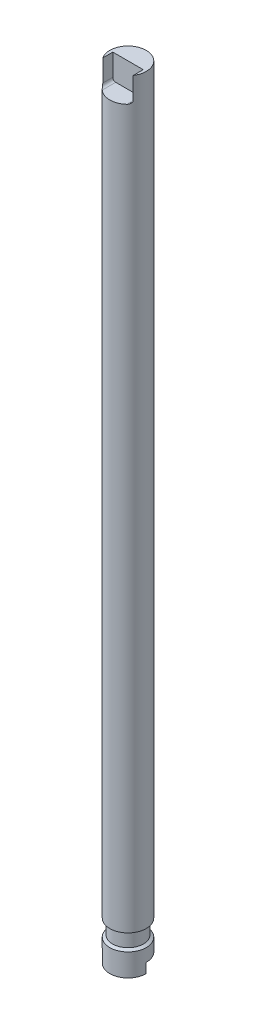
ISO-10303-21;
HEADER;
FILE_DESCRIPTION(('STEP AP214'),'2;1');
FILE_NAME('part.step','',(''),(''),'','','');
FILE_SCHEMA(('AUTOMOTIVE_DESIGN { 1 0 10303 214 1 1 1 1 }'));
ENDSEC;
DATA;
#1=APPLICATION_CONTEXT('core data for automotive mechanical design processes');
#2=APPLICATION_PROTOCOL_DEFINITION('international standard','automotive_design',2000,#1);
#3=PRODUCT_CONTEXT('',#1,'mechanical');
#4=PRODUCT('Part','Part','',(#3));
#5=PRODUCT_RELATED_PRODUCT_CATEGORY('part','',(#4));
#6=PRODUCT_DEFINITION_FORMATION('','',#4);
#7=PRODUCT_DEFINITION_CONTEXT('part definition',#1,'design');
#8=PRODUCT_DEFINITION('design','',#6,#7);
#9=PRODUCT_DEFINITION_SHAPE('','',#8);
#10=(LENGTH_UNIT() NAMED_UNIT(*) SI_UNIT(.MILLI.,.METRE.));
#11=(NAMED_UNIT(*) PLANE_ANGLE_UNIT() SI_UNIT($,.RADIAN.));
#12=(NAMED_UNIT(*) SI_UNIT($,.STERADIAN.) SOLID_ANGLE_UNIT());
#13=UNCERTAINTY_MEASURE_WITH_UNIT(LENGTH_MEASURE(1.E-05),#10,'distance_accuracy_value','');
#14=(GEOMETRIC_REPRESENTATION_CONTEXT(3) GLOBAL_UNCERTAINTY_ASSIGNED_CONTEXT((#13)) GLOBAL_UNIT_ASSIGNED_CONTEXT((#10,
#11,#12)) REPRESENTATION_CONTEXT('',''));
#15=CARTESIAN_POINT('',(0.,0.,0.));
#16=DIRECTION('',(0.,0.,1.));
#17=DIRECTION('',(1.,0.,0.));
#18=AXIS2_PLACEMENT_3D('',#15,#16,#17);
#19=CARTESIAN_POINT('',(-6.42480725316302E-06,661.678554121148,0.0981200194328381));
#20=DIRECTION('',(0.,-1.,0.));
#21=DIRECTION('',(0.,0.,-1.));
#22=AXIS2_PLACEMENT_3D('',#19,#20,#21);
#23=CYLINDRICAL_SURFACE('',#22,28.);
#24=DIRECTION('',(0.,1.,0.));
#25=VECTOR('',#24,1.);
#26=CARTESIAN_POINT('',(27.9999935751927,-538.321445878852,0.0981200194328381));
#27=LINE('',#26,#25);
#28=CARTESIAN_POINT('',(27.9999935751927,-538.321445878852,0.0981200194328381));
#29=VERTEX_POINT('',#28);
#30=CARTESIAN_POINT('',(27.9999935751927,-523.321445878852,0.0981200194328381));
#31=VERTEX_POINT('',#30);
#32=EDGE_CURVE('E60',#29,#31,#27,.T.);
#33=ORIENTED_EDGE('',*,*,#32,.T.);
#34=CARTESIAN_POINT('',(-6.42480725316302E-06,-523.321445878852,0.0981200194328381));
#35=DIRECTION('',(0.,1.,0.));
#36=DIRECTION('',(0.,0.,1.));
#37=AXIS2_PLACEMENT_3D('',#34,#35,#36);
#38=CIRCLE('',#37,28.);
#39=CARTESIAN_POINT('',(-28.0000064248073,-523.321445878852,0.0981200194328381));
#40=VERTEX_POINT('',#39);
#41=EDGE_CURVE('E166',#31,#40,#38,.T.);
#42=ORIENTED_EDGE('',*,*,#41,.T.);
#43=DIRECTION('',(0.,-1.,0.));
#44=VECTOR('',#43,1.);
#45=CARTESIAN_POINT('',(-28.0000064248073,-538.321445878852,0.0981200194328381));
#46=LINE('',#45,#44);
#47=CARTESIAN_POINT('',(-28.0000064248073,-538.321445878852,0.0981200194328381));
#48=VERTEX_POINT('',#47);
#49=EDGE_CURVE('E153',#40,#48,#46,.T.);
#50=ORIENTED_EDGE('',*,*,#49,.T.);
#51=CARTESIAN_POINT('',(-6.42480725316302E-06,-538.321445878852,0.0981200194328381));
#52=DIRECTION('',(0.,1.,0.));
#53=DIRECTION('',(0.,0.,1.));
#54=AXIS2_PLACEMENT_3D('',#51,#52,#53);
#55=CIRCLE('',#54,28.);
#56=EDGE_CURVE('E162',#48,#29,#55,.T.);
#57=ORIENTED_EDGE('',*,*,#56,.T.);
#58=EDGE_LOOP('',(#33,#42,#50,#57));
#59=FACE_BOUND('',#58,.T.);
#60=CARTESIAN_POINT('',(-6.42480725316302E-06,-503.654638122471,0.0981200194328381));
#61=DIRECTION('',(0.,-1.,0.));
#62=DIRECTION('',(0.,0.,-1.));
#63=AXIS2_PLACEMENT_3D('',#60,#61,#62);
#64=CIRCLE('',#63,28.);
#65=CARTESIAN_POINT('',(-6.42480725316302E-06,-503.654638122471,-27.9018799805672));
#66=VERTEX_POINT('',#65);
#67=EDGE_CURVE('E150',#66,#66,#64,.T.);
#68=ORIENTED_EDGE('',*,*,#67,.T.);
#69=EDGE_LOOP('',(#68));
#70=FACE_BOUND('',#69,.T.);
#71=ADVANCED_FACE('F37',(#59,#70),#23,.T.);
#72=CARTESIAN_POINT('',(-6.42480725316302E-06,-538.321445878852,0.0981200194328381));
#73=DIRECTION('',(0.,1.,0.));
#74=DIRECTION('',(0.,0.,1.));
#75=AXIS2_PLACEMENT_3D('',#72,#73,#74);
#76=PLANE('',#75);
#77=DIRECTION('',(1.,0.,0.));
#78=VECTOR('',#77,1.);
#79=CARTESIAN_POINT('',(-28.0000064248073,-538.321445878852,0.0981200194328381));
#80=LINE('',#79,#78);
#81=EDGE_CURVE('E156',#48,#29,#80,.T.);
#82=ORIENTED_EDGE('',*,*,#81,.T.);
#83=ORIENTED_EDGE('',*,*,#56,.F.);
#84=EDGE_LOOP('',(#82,#83));
#85=FACE_BOUND('',#84,.T.);
#86=ADVANCED_FACE('F209',(#85),#76,.F.);
#87=CARTESIAN_POINT('',(-28.0000064248073,-523.321445878852,-27.9018799805672));
#88=DIRECTION('',(0.,1.,0.));
#89=DIRECTION('',(0.,0.,1.));
#90=AXIS2_PLACEMENT_3D('',#87,#88,#89);
#91=PLANE('',#90);
#92=DIRECTION('',(-1.,0.,0.));
#93=VECTOR('',#92,1.);
#94=CARTESIAN_POINT('',(-28.0000064248073,-523.321445878852,0.0981200194328381));
#95=LINE('',#94,#93);
#96=EDGE_CURVE('E159',#31,#40,#95,.T.);
#97=ORIENTED_EDGE('',*,*,#96,.T.);
#98=ORIENTED_EDGE('',*,*,#41,.F.);
#99=EDGE_LOOP('',(#97,#98));
#100=FACE_BOUND('',#99,.T.);
#101=ADVANCED_FACE('F206',(#100),#91,.F.);
#102=CARTESIAN_POINT('',(-28.0000064248073,-523.321445878852,0.0981200194328381));
#103=DIRECTION('',(0.,0.,-1.));
#104=DIRECTION('',(-1.,0.,0.));
#105=AXIS2_PLACEMENT_3D('',#102,#103,#104);
#106=PLANE('',#105);
#107=ORIENTED_EDGE('',*,*,#49,.F.);
#108=ORIENTED_EDGE('',*,*,#96,.F.);
#109=ORIENTED_EDGE('',*,*,#32,.F.);
#110=ORIENTED_EDGE('',*,*,#81,.F.);
#111=EDGE_LOOP('',(#107,#108,#109,#110));
#112=FACE_BOUND('',#111,.T.);
#113=ADVANCED_FACE('F202',(#112),#106,.T.);
#114=CARTESIAN_POINT('',(-6.42480725316302E-06,-503.654638122471,0.0981200194328381));
#115=DIRECTION('',(0.,-1.,0.));
#116=DIRECTION('',(0.,0.,-1.));
#117=AXIS2_PLACEMENT_3D('',#114,#115,#116);
#118=CONICAL_SURFACE('',#117,28.,1.01229096615671);
#119=CARTESIAN_POINT('',(-6.42480725316302E-06,-501.005041801305,0.0981200194328381));
#120=DIRECTION('',(0.,-1.,0.));
#121=DIRECTION('',(0.,0.,-1.));
#122=AXIS2_PLACEMENT_3D('',#119,#120,#121);
#123=CIRCLE('',#122,23.7597595192179);
#124=CARTESIAN_POINT('',(-6.42480725316302E-06,-501.005041801305,-23.661639499785));
#125=VERTEX_POINT('',#124);
#126=EDGE_CURVE('E147',#125,#125,#123,.T.);
#127=ORIENTED_EDGE('',*,*,#126,.T.);
#128=EDGE_LOOP('',(#127));
#129=FACE_BOUND('',#128,.T.);
#130=ORIENTED_EDGE('',*,*,#67,.F.);
#131=EDGE_LOOP('',(#130));
#132=FACE_BOUND('',#131,.T.);
#133=ADVANCED_FACE('F198',(#129,#132),#118,.T.);
#134=CARTESIAN_POINT('',(-6.42480725316302E-06,-538.321445878852,0.0981200194328381));
#135=DIRECTION('',(0.,-1.,0.));
#136=DIRECTION('',(0.,0.,-1.));
#137=AXIS2_PLACEMENT_3D('',#134,#135,#136);
#138=CYLINDRICAL_SURFACE('',#137,23.7597595192179);
#139=CARTESIAN_POINT('',(-6.42480725316302E-06,-481.005041801305,0.0981200194328381));
#140=DIRECTION('',(0.,-1.,0.));
#141=DIRECTION('',(0.,0.,-1.));
#142=AXIS2_PLACEMENT_3D('',#139,#140,#141);
#143=CIRCLE('',#142,23.7597595192179);
#144=CARTESIAN_POINT('',(-6.42480725316302E-06,-481.005041801305,-23.661639499785));
#145=VERTEX_POINT('',#144);
#146=EDGE_CURVE('E144',#145,#145,#143,.T.);
#147=ORIENTED_EDGE('',*,*,#146,.T.);
#148=EDGE_LOOP('',(#147));
#149=FACE_BOUND('',#148,.T.);
#150=ORIENTED_EDGE('',*,*,#126,.F.);
#151=EDGE_LOOP('',(#150));
#152=FACE_BOUND('',#151,.T.);
#153=ADVANCED_FACE('F194',(#149,#152),#138,.T.);
#154=CARTESIAN_POINT('',(-6.42480725316302E-06,-481.005041801305,0.0981200194328381));
#155=DIRECTION('',(0.,1.,0.));
#156=DIRECTION('',(0.,0.,1.));
#157=AXIS2_PLACEMENT_3D('',#154,#155,#156);
#158=CONICAL_SURFACE('',#157,23.7597595192179,1.01229096615672);
#159=CARTESIAN_POINT('',(-6.42480725316302E-06,-478.355445480139,0.0981200194328381));
#160=DIRECTION('',(0.,-1.,0.));
#161=DIRECTION('',(0.,0.,-1.));
#162=AXIS2_PLACEMENT_3D('',#159,#160,#161);
#163=CIRCLE('',#162,27.9999999999999);
#164=CARTESIAN_POINT('',(-6.42480725316302E-06,-478.355445480139,-27.9018799805671));
#165=VERTEX_POINT('',#164);
#166=EDGE_CURVE('E141',#165,#165,#163,.T.);
#167=ORIENTED_EDGE('',*,*,#166,.T.);
#168=EDGE_LOOP('',(#167));
#169=FACE_BOUND('',#168,.T.);
#170=ORIENTED_EDGE('',*,*,#146,.F.);
#171=EDGE_LOOP('',(#170));
#172=FACE_BOUND('',#171,.T.);
#173=ADVANCED_FACE('F190',(#169,#172),#158,.T.);
#174=CARTESIAN_POINT('',(-6.42480725316302E-06,661.678554121148,0.0981200194328381));
#175=DIRECTION('',(0.,1.,0.));
#176=DIRECTION('',(0.,0.,1.));
#177=AXIS2_PLACEMENT_3D('',#174,#175,#176);
#178=PLANE('',#177);
#179=DIRECTION('',(0.,0.,-1.));
#180=VECTOR('',#179,1.);
#181=CARTESIAN_POINT('',(23.3777765106786,661.678554121148,0.0981200194328381));
#182=LINE('',#181,#180);
#183=CARTESIAN_POINT('',(23.3777765106786,661.678554121148,15.5084822806293));
#184=VERTEX_POINT('',#183);
#185=CARTESIAN_POINT('',(23.3777765106786,661.678554121148,0.0971200194328381));
#186=VERTEX_POINT('',#185);
#187=EDGE_CURVE('E139',#184,#186,#182,.T.);
#188=ORIENTED_EDGE('',*,*,#187,.F.);
#189=CARTESIAN_POINT('',(-6.42480725316302E-06,661.678554121148,0.0981200194328381));
#190=DIRECTION('',(0.,1.,0.));
#191=DIRECTION('',(0.,0.,1.));
#192=AXIS2_PLACEMENT_3D('',#189,#190,#191);
#193=CIRCLE('',#192,28.);
#194=CARTESIAN_POINT('',(-23.3777893602931,661.678554121148,15.5084822806293));
#195=VERTEX_POINT('',#194);
#196=EDGE_CURVE('E163',#184,#195,#193,.T.);
#197=ORIENTED_EDGE('',*,*,#196,.T.);
#198=DIRECTION('',(0.,0.,1.));
#199=VECTOR('',#198,1.);
#200=CARTESIAN_POINT('',(-23.3777893602931,661.678554121148,0.0981200194328381));
#201=LINE('',#200,#199);
#202=CARTESIAN_POINT('',(-23.3777893602931,661.678554121148,0.0971200194328381));
#203=VERTEX_POINT('',#202);
#204=EDGE_CURVE('E52',#203,#195,#201,.T.);
#205=ORIENTED_EDGE('',*,*,#204,.F.);
#206=DIRECTION('',(-1.,0.,0.));
#207=VECTOR('',#206,1.);
#208=CARTESIAN_POINT('',(-6.42480725316302E-06,661.678554121148,0.0971200194328381));
#209=LINE('',#208,#207);
#210=EDGE_CURVE('E11',#186,#203,#209,.T.);
#211=ORIENTED_EDGE('',*,*,#210,.F.);
#212=EDGE_LOOP('',(#188,#197,#205,#211));
#213=FACE_BOUND('',#212,.T.);
#214=ADVANCED_FACE('F193',(#213),#178,.T.);
#215=ORIENTED_EDGE('',*,*,#196,.F.);
#216=DIRECTION('',(0.,-1.,0.));
#217=VECTOR('',#216,1.);
#218=CARTESIAN_POINT('',(23.3777765106786,661.678554121148,15.5084822806293));
#219=LINE('',#218,#217);
#220=CARTESIAN_POINT('',(23.3777765106786,628.129239556559,15.5084822806292));
#221=VERTEX_POINT('',#220);
#222=EDGE_CURVE('E45',#184,#221,#219,.T.);
#223=ORIENTED_EDGE('',*,*,#222,.T.);
#224=CARTESIAN_POINT('',(23.3777765106786,628.129239556559,15.5084822806292));
#225=CARTESIAN_POINT('',(23.3777919035231,628.054904144362,15.5084544615388));
#226=CARTESIAN_POINT('',(23.3759119449711,627.980586727826,15.5113107862228));
#227=CARTESIAN_POINT('',(23.3684817401791,627.832639668801,15.5225760134232));
#228=CARTESIAN_POINT('',(23.3629355980985,627.759009350494,15.5309787069658));
#229=CARTESIAN_POINT('',(23.3483729865745,627.61371808586,15.5530008109456));
#230=CARTESIAN_POINT('',(23.3393951165731,627.542044409914,15.5665621895259));
#231=CARTESIAN_POINT('',(23.3181712165071,627.400279991031,15.5985380935921));
#232=CARTESIAN_POINT('',(23.3059241064214,627.330189779519,15.6169542228608));
#233=CARTESIAN_POINT('',(23.2576166976408,627.087735340214,15.6893626308562));
#234=CARTESIAN_POINT('',(23.2134779664327,626.920374679923,15.7551529745621));
#235=CARTESIAN_POINT('',(23.1098633477978,626.600144344602,15.9076861567903));
#236=CARTESIAN_POINT('',(23.0503144805127,626.447348490948,15.9945285671676));
#237=CARTESIAN_POINT('',(22.9340262036917,626.189526192579,16.1616843826552));
#238=CARTESIAN_POINT('',(22.8796598938106,626.081478682155,16.2390832172049));
#239=CARTESIAN_POINT('',(22.7648364141274,625.87394328359,16.400627409223));
#240=CARTESIAN_POINT('',(22.7043758638795,625.77446020345,16.4847765056871));
#241=CARTESIAN_POINT('',(22.5781511893908,625.583457260051,16.6582627704653));
#242=CARTESIAN_POINT('',(22.5123795577947,625.491949063004,16.7476072308495));
#243=CARTESIAN_POINT('',(22.3762131764753,625.316524569135,16.9301663563632));
#244=CARTESIAN_POINT('',(22.3058169535658,625.232610711967,17.0233822512452));
#245=CARTESIAN_POINT('',(22.1193303998232,625.025899009628,17.2669886841202));
#246=CARTESIAN_POINT('',(22.000174498846,624.908378594676,17.4195290877903));
#247=CARTESIAN_POINT('',(21.7528649232343,624.68982836006,17.7291131146236));
#248=CARTESIAN_POINT('',(21.6247064395241,624.588807451527,17.8861591177184));
#249=CARTESIAN_POINT('',(21.3602571128402,624.402574430618,18.2028629772701));
#250=CARTESIAN_POINT('',(21.223963005937,624.317368720245,18.3625218630895));
#251=CARTESIAN_POINT('',(20.9440110964524,624.162587709198,18.6828820253842));
#252=CARTESIAN_POINT('',(20.8003547466537,624.093009339274,18.8435830907825));
#253=CARTESIAN_POINT('',(20.5195414516376,623.975168694211,19.1503486788971));
#254=CARTESIAN_POINT('',(20.382966268335,623.92555015455,19.2964265281533));
#255=CARTESIAN_POINT('',(20.1047161495802,623.839703921346,19.5876220803607));
#256=CARTESIAN_POINT('',(19.9630420368739,623.803474077985,19.7327399337797));
#257=CARTESIAN_POINT('',(19.6756300623034,623.745036706463,20.020732775653));
#258=CARTESIAN_POINT('',(19.5299086719015,623.722779151621,20.1636139590764));
#259=CARTESIAN_POINT('',(19.2345362075251,623.692823119087,20.4469405882641));
#260=CARTESIAN_POINT('',(19.0848833950966,623.685131195969,20.5873849092796));
#261=CARTESIAN_POINT('',(18.9336406758704,623.685103721751,20.7261836092854));
#262=B_SPLINE_CURVE_WITH_KNOTS('',3,(#224,#225,#226,#227,#228,#229,#230,#231,#232,#233,#234,
#235,#236,#237,#238,#239,#240,#241,#242,#243,#244,#245,#246,#247,#248,#249,#250,#251,#252,#253,
#254,#255,#256,#257,#258,#259,#260,#261),.UNSPECIFIED.,.F.,.F.,(4,2,2,2,2,2,2,2,2,2,2,2,2,2,2,2,
2,2,4),(0.,0.222898433809815,0.445547762533881,0.665763150081201,0.886051377861803,
1.43821732523204,1.99304768277355,2.42325962564008,2.85371153215397,3.28478291849344,
3.71599229693829,4.39433434424841,5.07304155085521,5.75202290225591,6.43087078313588,
7.0485140602989,7.6660581195503,8.2813783073091,8.89697532513863),.UNSPECIFIED.);
#263=CARTESIAN_POINT('',(18.9336406758704,623.685103721751,20.7261836092854));
#264=VERTEX_POINT('',#263);
#265=EDGE_CURVE('E246',#221,#264,#262,.T.);
#266=ORIENTED_EDGE('',*,*,#265,.T.);
#267=CARTESIAN_POINT('',(-6.42480725316302E-06,623.685103721751,0.0981200194328381));
#268=DIRECTION('',(0.,-1.,0.));
#269=DIRECTION('',(1.,0.,0.));
#270=AXIS2_PLACEMENT_3D('',#267,#268,#269);
#271=CIRCLE('',#270,28.);
#272=CARTESIAN_POINT('',(-18.9336535254849,623.685103721751,20.7261836092854));
#273=VERTEX_POINT('',#272);
#274=EDGE_CURVE('E171',#264,#273,#271,.T.);
#275=ORIENTED_EDGE('',*,*,#274,.T.);
#276=CARTESIAN_POINT('',(-18.9336535254849,623.685103721751,20.7261836092854));
#277=CARTESIAN_POINT('',(-19.0211158218245,623.685106914873,20.6459070385766));
#278=CARTESIAN_POINT('',(-19.1080507496587,623.687685421771,20.5650864570753));
#279=CARTESIAN_POINT('',(-19.2807225715332,623.697832167666,20.402504668778));
#280=CARTESIAN_POINT('',(-19.3664596157962,623.705399775155,20.3207435823156));
#281=CARTESIAN_POINT('',(-19.6215869619806,623.735333644631,20.0743414003994));
#282=CARTESIAN_POINT('',(-19.7890018324638,623.764931357838,19.9084818890658));
#283=CARTESIAN_POINT('',(-20.119424451941,623.84281311796,19.5728513212678));
#284=CARTESIAN_POINT('',(-20.2823569770156,623.89131334662,19.403057202839));
#285=CARTESIAN_POINT('',(-20.600961979932,624.006242044862,19.0626913478679));
#286=CARTESIAN_POINT('',(-20.7566337080121,624.072672361148,18.8921195330071));
#287=CARTESIAN_POINT('',(-21.0613517119529,624.223802213254,18.5500219510188));
#288=CARTESIAN_POINT('',(-21.2103238419853,624.308664231276,18.3785018483234));
#289=CARTESIAN_POINT('',(-21.4993523726191,624.496437515468,18.0376864959157));
#290=CARTESIAN_POINT('',(-21.6394056989485,624.599354959853,17.8683920291565));
#291=CARTESIAN_POINT('',(-21.9088055353871,624.823284649204,17.5351543386115));
#292=CARTESIAN_POINT('',(-22.0382062209222,624.944195255744,17.3711869854323));
#293=CARTESIAN_POINT('',(-22.2856292235838,625.205714928924,17.05075612577));
#294=CARTESIAN_POINT('',(-22.4036644046651,625.346301272631,16.8942842388933));
#295=CARTESIAN_POINT('',(-22.6083788458225,625.624924852862,16.6173878903521));
#296=CARTESIAN_POINT('',(-22.6970477498724,625.759734346233,16.4952136932104));
#297=CARTESIAN_POINT('',(-22.8629606743067,626.04636125043,16.2630717850817));
#298=CARTESIAN_POINT('',(-22.940192680054,626.198196256778,16.1531169405406));
#299=CARTESIAN_POINT('',(-23.0810002350238,626.522554574174,15.9500343855544));
#300=CARTESIAN_POINT('',(-23.1443690658177,626.695338167505,15.8571642976124));
#301=CARTESIAN_POINT('',(-23.2243085315137,626.967548950017,15.7389027445058));
#302=CARTESIAN_POINT('',(-23.2484043134867,627.060268727691,15.7030381152431));
#303=CARTESIAN_POINT('',(-23.2909590779609,627.249669364815,15.6394513152687));
#304=CARTESIAN_POINT('',(-23.3094222019206,627.34634725442,15.61172316272));
#305=CARTESIAN_POINT('',(-23.3420268505961,627.555526990735,15.5626304087963));
#306=CARTESIAN_POINT('',(-23.3553147097263,627.668472301438,15.5425316659883));
#307=CARTESIAN_POINT('',(-23.3687344592005,627.839880213308,15.5222118751331));
#308=CARTESIAN_POINT('',(-23.3721226689448,627.897552497854,15.5170761359814));
#309=CARTESIAN_POINT('',(-23.3766524573372,628.013222565168,15.5102071159059));
#310=CARTESIAN_POINT('',(-23.3777926377524,628.071220528029,15.5084759525674));
#311=CARTESIAN_POINT('',(-23.377789360293,628.129239556559,15.5084822806294));
#312=B_SPLINE_CURVE_WITH_KNOTS('',3,(#276,#277,#278,#279,#280,#281,#282,#283,#284,#285,#286,
#287,#288,#289,#290,#291,#292,#293,#294,#295,#296,#297,#298,#299,#300,#301,#302,#303,#304,#305,
#306,#307,#308,#309,#310,#311),.UNSPECIFIED.,.F.,.F.,(4,2,2,2,2,2,2,2,2,2,2,2,2,2,2,2,2,4),(0.,
0.356086619523373,0.712128175146788,1.42377146449635,2.14380439820418,2.86391151981576,
3.59064481165629,4.31762726424932,5.04064899192835,5.76284250935063,6.36886416712219,
6.97551801119036,7.5906799853254,7.89709105925751,8.203276295896,8.54858556914401,
8.72245729541061,8.89643713262953),.UNSPECIFIED.);
#313=CARTESIAN_POINT('',(-23.3777893602931,628.129239556559,15.5084822806293));
#314=VERTEX_POINT('',#313);
#315=EDGE_CURVE('E174',#273,#314,#312,.T.);
#316=ORIENTED_EDGE('',*,*,#315,.T.);
#317=DIRECTION('',(0.,-1.,0.));
#318=VECTOR('',#317,1.);
#319=CARTESIAN_POINT('',(-23.3777893602931,661.678554121148,15.5084822806293));
#320=LINE('',#319,#318);
#321=EDGE_CURVE('E114',#314,#195,#320,.F.);
#322=ORIENTED_EDGE('',*,*,#321,.T.);
#323=EDGE_LOOP('',(#215,#223,#266,#275,#316,#322));
#324=FACE_BOUND('',#323,.T.);
#325=ORIENTED_EDGE('',*,*,#166,.F.);
#326=EDGE_LOOP('',(#325));
#327=FACE_BOUND('',#326,.T.);
#328=ADVANCED_FACE('F212',(#324,#327),#23,.T.);
#329=CARTESIAN_POINT('',(18.9336406758704,628.129239556559,0.0971200194328381));
#330=DIRECTION('',(0.,0.,1.));
#331=DIRECTION('',(1.,0.,0.));
#332=AXIS2_PLACEMENT_3D('',#329,#330,#331);
#333=CYLINDRICAL_SURFACE('',#332,4.44413583480819);
#334=DIRECTION('',(0.,0.,1.));
#335=VECTOR('',#334,1.);
#336=CARTESIAN_POINT('',(23.3777765106786,628.129239556559,0.0971200194328381));
#337=LINE('',#336,#335);
#338=CARTESIAN_POINT('',(23.3777765106786,628.129239556559,0.0971200194328381));
#339=VERTEX_POINT('',#338);
#340=EDGE_CURVE('E131',#339,#221,#337,.T.);
#341=ORIENTED_EDGE('',*,*,#340,.F.);
#342=CARTESIAN_POINT('',(18.9336406758704,628.129239556559,0.0971200194328381));
#343=DIRECTION('',(0.,0.,1.));
#344=DIRECTION('',(-1.,0.,0.));
#345=AXIS2_PLACEMENT_3D('',#342,#343,#344);
#346=CIRCLE('',#345,4.44413583480819);
#347=CARTESIAN_POINT('',(18.9336406758704,623.685103721751,0.0971200194328381));
#348=VERTEX_POINT('',#347);
#349=EDGE_CURVE('E125',#348,#339,#346,.T.);
#350=ORIENTED_EDGE('',*,*,#349,.F.);
#351=DIRECTION('',(0.,0.,1.));
#352=VECTOR('',#351,1.);
#353=CARTESIAN_POINT('',(18.9336406758704,623.685103721751,0.0971200194328381));
#354=LINE('',#353,#352);
#355=EDGE_CURVE('E134',#348,#264,#354,.T.);
#356=ORIENTED_EDGE('',*,*,#355,.T.);
#357=ORIENTED_EDGE('',*,*,#265,.F.);
#358=EDGE_LOOP('',(#341,#350,#356,#357));
#359=FACE_BOUND('',#358,.T.);
#360=ADVANCED_FACE('F227',(#359),#333,.F.);
#361=CARTESIAN_POINT('',(-18.9336535254849,623.685103721751,0.0971200194328381));
#362=DIRECTION('',(0.,-1.,0.));
#363=DIRECTION('',(1.,0.,0.));
#364=AXIS2_PLACEMENT_3D('',#361,#362,#363);
#365=PLANE('',#364);
#366=ORIENTED_EDGE('',*,*,#355,.F.);
#367=DIRECTION('',(1.,0.,0.));
#368=VECTOR('',#367,1.);
#369=CARTESIAN_POINT('',(-18.9336535254849,623.685103721751,0.0971200194328381));
#370=LINE('',#369,#368);
#371=CARTESIAN_POINT('',(-18.9336535254849,623.685103721751,0.0971200194328381));
#372=VERTEX_POINT('',#371);
#373=EDGE_CURVE('E123',#372,#348,#370,.T.);
#374=ORIENTED_EDGE('',*,*,#373,.F.);
#375=DIRECTION('',(0.,0.,1.));
#376=VECTOR('',#375,1.);
#377=CARTESIAN_POINT('',(-18.9336535254849,623.685103721751,0.0971200194328381));
#378=LINE('',#377,#376);
#379=EDGE_CURVE('E117',#372,#273,#378,.T.);
#380=ORIENTED_EDGE('',*,*,#379,.T.);
#381=ORIENTED_EDGE('',*,*,#274,.F.);
#382=EDGE_LOOP('',(#366,#374,#380,#381));
#383=FACE_BOUND('',#382,.T.);
#384=ADVANCED_FACE('F186',(#383),#365,.F.);
#385=CARTESIAN_POINT('',(-18.9336535254849,628.129239556559,0.0971200194328381));
#386=DIRECTION('',(0.,0.,1.));
#387=DIRECTION('',(1.,0.,0.));
#388=AXIS2_PLACEMENT_3D('',#385,#386,#387);
#389=CYLINDRICAL_SURFACE('',#388,4.44413583480806);
#390=ORIENTED_EDGE('',*,*,#379,.F.);
#391=CARTESIAN_POINT('',(-18.9336535254849,628.129239556559,0.0971200194328381));
#392=DIRECTION('',(0.,0.,1.));
#393=DIRECTION('',(1.,0.,0.));
#394=AXIS2_PLACEMENT_3D('',#391,#392,#393);
#395=CIRCLE('',#394,4.44413583480806);
#396=CARTESIAN_POINT('',(-23.3777893602931,628.129239556559,0.0971200194328381));
#397=VERTEX_POINT('',#396);
#398=EDGE_CURVE('E107',#397,#372,#395,.T.);
#399=ORIENTED_EDGE('',*,*,#398,.F.);
#400=DIRECTION('',(0.,0.,1.));
#401=VECTOR('',#400,1.);
#402=CARTESIAN_POINT('',(-23.3777893602931,628.129239556559,0.0971200194328381));
#403=LINE('',#402,#401);
#404=EDGE_CURVE('E112',#397,#314,#403,.T.);
#405=ORIENTED_EDGE('',*,*,#404,.T.);
#406=ORIENTED_EDGE('',*,*,#315,.F.);
#407=EDGE_LOOP('',(#390,#399,#405,#406));
#408=FACE_BOUND('',#407,.T.);
#409=ADVANCED_FACE('F120',(#408),#389,.F.);
#410=CARTESIAN_POINT('',(23.3777765106786,665.191065115474,0.0971200194328381));
#411=DIRECTION('',(1.,0.,0.));
#412=DIRECTION('',(0.,0.,-1.));
#413=AXIS2_PLACEMENT_3D('',#410,#411,#412);
#414=PLANE('',#413);
#415=ORIENTED_EDGE('',*,*,#187,.T.);
#416=DIRECTION('',(0.,1.,0.));
#417=VECTOR('',#416,1.);
#418=CARTESIAN_POINT('',(23.3777765106786,665.191065115474,0.0971200194328381));
#419=LINE('',#418,#417);
#420=EDGE_CURVE('E118',#339,#186,#419,.T.);
#421=ORIENTED_EDGE('',*,*,#420,.F.);
#422=ORIENTED_EDGE('',*,*,#340,.T.);
#423=ORIENTED_EDGE('',*,*,#222,.F.);
#424=EDGE_LOOP('',(#415,#421,#422,#423));
#425=FACE_BOUND('',#424,.T.);
#426=ADVANCED_FACE('F185',(#425),#414,.F.);
#427=CARTESIAN_POINT('',(-23.3777893602931,665.191065115474,0.0971200194328381));
#428=DIRECTION('',(-1.,0.,0.));
#429=DIRECTION('',(0.,0.,1.));
#430=AXIS2_PLACEMENT_3D('',#427,#428,#429);
#431=PLANE('',#430);
#432=ORIENTED_EDGE('',*,*,#204,.T.);
#433=ORIENTED_EDGE('',*,*,#321,.F.);
#434=ORIENTED_EDGE('',*,*,#404,.F.);
#435=DIRECTION('',(0.,-1.,0.));
#436=VECTOR('',#435,1.);
#437=CARTESIAN_POINT('',(-23.3777893602931,665.191065115474,0.0971200194328381));
#438=LINE('',#437,#436);
#439=EDGE_CURVE('E102',#203,#397,#438,.T.);
#440=ORIENTED_EDGE('',*,*,#439,.F.);
#441=EDGE_LOOP('',(#432,#433,#434,#440));
#442=FACE_BOUND('',#441,.T.);
#443=ADVANCED_FACE('F113',(#442),#431,.F.);
#444=CARTESIAN_POINT('',(18.9336406758704,628.129239556559,0.0971200194328381));
#445=DIRECTION('',(0.,0.,-1.));
#446=DIRECTION('',(-1.,0.,0.));
#447=AXIS2_PLACEMENT_3D('',#444,#445,#446);
#448=PLANE('',#447);
#449=ORIENTED_EDGE('',*,*,#210,.T.);
#450=ORIENTED_EDGE('',*,*,#439,.T.);
#451=ORIENTED_EDGE('',*,*,#398,.T.);
#452=ORIENTED_EDGE('',*,*,#373,.T.);
#453=ORIENTED_EDGE('',*,*,#349,.T.);
#454=ORIENTED_EDGE('',*,*,#420,.T.);
#455=EDGE_LOOP('',(#449,#450,#451,#452,#453,#454));
#456=FACE_BOUND('',#455,.T.);
#457=ADVANCED_FACE('F104',(#456),#448,.F.);
#458=CLOSED_SHELL('',(#71,#86,#101,#113,#133,#153,#173,#214,#328,#360,#384,#409,#426,#443,#457));
#459=MANIFOLD_SOLID_BREP('B2',#458);
#460=ADVANCED_BREP_SHAPE_REPRESENTATION('',(#18,#459),#14);
#461=SHAPE_DEFINITION_REPRESENTATION(#9,#460);
ENDSEC;
END-ISO-10303-21;
